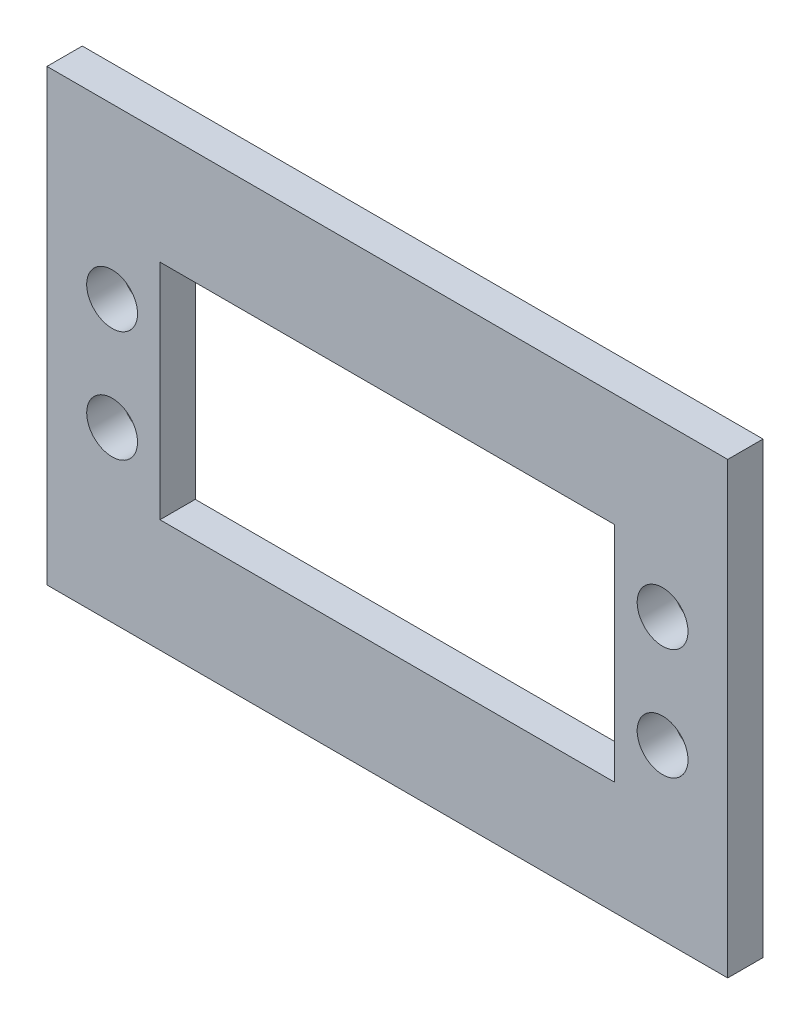
ISO-10303-21;
HEADER;
FILE_DESCRIPTION(('STEP AP214'),'2;1');
FILE_NAME('part.step','',(''),(''),'','','');
FILE_SCHEMA(('AUTOMOTIVE_DESIGN { 1 0 10303 214 1 1 1 1 }'));
ENDSEC;
DATA;
#1=APPLICATION_CONTEXT('core data for automotive mechanical design processes');
#2=APPLICATION_PROTOCOL_DEFINITION('international standard','automotive_design',2000,#1);
#3=PRODUCT_CONTEXT('',#1,'mechanical');
#4=PRODUCT('Part','Part','',(#3));
#5=PRODUCT_RELATED_PRODUCT_CATEGORY('part','',(#4));
#6=PRODUCT_DEFINITION_FORMATION('','',#4);
#7=PRODUCT_DEFINITION_CONTEXT('part definition',#1,'design');
#8=PRODUCT_DEFINITION('design','',#6,#7);
#9=PRODUCT_DEFINITION_SHAPE('','',#8);
#10=(LENGTH_UNIT() NAMED_UNIT(*) SI_UNIT(.MILLI.,.METRE.));
#11=(NAMED_UNIT(*) PLANE_ANGLE_UNIT() SI_UNIT($,.RADIAN.));
#12=(NAMED_UNIT(*) SI_UNIT($,.STERADIAN.) SOLID_ANGLE_UNIT());
#13=UNCERTAINTY_MEASURE_WITH_UNIT(LENGTH_MEASURE(1.E-05),#10,'distance_accuracy_value','');
#14=(GEOMETRIC_REPRESENTATION_CONTEXT(3) GLOBAL_UNCERTAINTY_ASSIGNED_CONTEXT((#13)) GLOBAL_UNIT_ASSIGNED_CONTEXT((#10,
#11,#12)) REPRESENTATION_CONTEXT('',''));
#15=CARTESIAN_POINT('',(0.,0.,0.));
#16=DIRECTION('',(0.,0.,1.));
#17=DIRECTION('',(1.,0.,0.));
#18=AXIS2_PLACEMENT_3D('',#15,#16,#17);
#19=CARTESIAN_POINT('',(0.,0.,3.175));
#20=DIRECTION('',(0.,0.,1.));
#21=DIRECTION('',(1.,0.,0.));
#22=AXIS2_PLACEMENT_3D('',#19,#20,#21);
#23=PLANE('',#22);
#24=CARTESIAN_POINT('',(45.197,15.033,3.175));
#25=DIRECTION('',(0.,0.,1.));
#26=DIRECTION('',(-1.,0.,0.));
#27=AXIS2_PLACEMENT_3D('',#24,#25,#26);
#28=CIRCLE('',#27,2.28599999999999);
#29=CARTESIAN_POINT('',(42.911,15.033,3.175));
#30=VERTEX_POINT('',#29);
#31=EDGE_CURVE('E258',#30,#30,#28,.T.);
#32=ORIENTED_EDGE('',*,*,#31,.F.);
#33=EDGE_LOOP('',(#32));
#34=FACE_BOUND('',#33,.T.);
#35=CARTESIAN_POINT('',(45.197,5.03300000000001,3.175));
#36=DIRECTION('',(0.,0.,1.));
#37=DIRECTION('',(1.,0.,0.));
#38=AXIS2_PLACEMENT_3D('',#35,#36,#37);
#39=CIRCLE('',#38,2.286);
#40=CARTESIAN_POINT('',(47.483,5.03300000000001,3.175));
#41=VERTEX_POINT('',#40);
#42=EDGE_CURVE('E250',#41,#41,#39,.T.);
#43=ORIENTED_EDGE('',*,*,#42,.F.);
#44=EDGE_LOOP('',(#43));
#45=FACE_BOUND('',#44,.T.);
#46=CARTESIAN_POINT('',(-4.303,5.033,3.175));
#47=DIRECTION('',(0.,0.,1.));
#48=DIRECTION('',(-1.,0.,0.));
#49=AXIS2_PLACEMENT_3D('',#46,#47,#48);
#50=CIRCLE('',#49,2.286);
#51=CARTESIAN_POINT('',(-6.589,5.033,3.175));
#52=VERTEX_POINT('',#51);
#53=EDGE_CURVE('E243',#52,#52,#50,.T.);
#54=ORIENTED_EDGE('',*,*,#53,.F.);
#55=EDGE_LOOP('',(#54));
#56=FACE_BOUND('',#55,.T.);
#57=CARTESIAN_POINT('',(-4.303,15.033,3.175));
#58=DIRECTION('',(0.,0.,1.));
#59=DIRECTION('',(1.,0.,0.));
#60=AXIS2_PLACEMENT_3D('',#57,#58,#59);
#61=CIRCLE('',#60,2.286);
#62=CARTESIAN_POINT('',(-2.017,15.033,3.175));
#63=VERTEX_POINT('',#62);
#64=EDGE_CURVE('E247',#63,#63,#61,.T.);
#65=ORIENTED_EDGE('',*,*,#64,.F.);
#66=EDGE_LOOP('',(#65));
#67=FACE_BOUND('',#66,.T.);
#68=DIRECTION('',(1.,0.,0.));
#69=VECTOR('',#68,1.);
#70=CARTESIAN_POINT('',(-10.16,-10.16,3.175));
#71=LINE('',#70,#69);
#72=CARTESIAN_POINT('',(-10.16,-10.16,3.175));
#73=VERTEX_POINT('',#72);
#74=CARTESIAN_POINT('',(51.054,-10.16,3.175));
#75=VERTEX_POINT('',#74);
#76=EDGE_CURVE('E140',#73,#75,#71,.T.);
#77=ORIENTED_EDGE('',*,*,#76,.T.);
#78=DIRECTION('',(0.,1.,0.));
#79=VECTOR('',#78,1.);
#80=CARTESIAN_POINT('',(51.054,-10.16,3.175));
#81=LINE('',#80,#79);
#82=CARTESIAN_POINT('',(51.054,30.226,3.175));
#83=VERTEX_POINT('',#82);
#84=EDGE_CURVE('E143',#75,#83,#81,.T.);
#85=ORIENTED_EDGE('',*,*,#84,.T.);
#86=DIRECTION('',(-1.,0.,0.));
#87=VECTOR('',#86,1.);
#88=CARTESIAN_POINT('',(-10.16,30.226,3.175));
#89=LINE('',#88,#87);
#90=CARTESIAN_POINT('',(-10.16,30.226,3.175));
#91=VERTEX_POINT('',#90);
#92=EDGE_CURVE('E146',#83,#91,#89,.T.);
#93=ORIENTED_EDGE('',*,*,#92,.T.);
#94=DIRECTION('',(0.,-1.,0.));
#95=VECTOR('',#94,1.);
#96=CARTESIAN_POINT('',(-10.16,-10.16,3.175));
#97=LINE('',#96,#95);
#98=EDGE_CURVE('E148',#91,#73,#97,.T.);
#99=ORIENTED_EDGE('',*,*,#98,.T.);
#100=EDGE_LOOP('',(#77,#85,#93,#99));
#101=FACE_BOUND('',#100,.T.);
#102=DIRECTION('',(1.,0.,0.));
#103=VECTOR('',#102,1.);
#104=CARTESIAN_POINT('',(0.,0.,3.175));
#105=LINE('',#104,#103);
#106=CARTESIAN_POINT('',(0.,0.,3.175));
#107=VERTEX_POINT('',#106);
#108=CARTESIAN_POINT('',(40.894,0.,3.175));
#109=VERTEX_POINT('',#108);
#110=EDGE_CURVE('E110',#107,#109,#105,.T.);
#111=ORIENTED_EDGE('',*,*,#110,.F.);
#112=DIRECTION('',(0.,-1.,0.));
#113=VECTOR('',#112,1.);
#114=CARTESIAN_POINT('',(0.,0.,3.175));
#115=LINE('',#114,#113);
#116=CARTESIAN_POINT('',(0.,20.066,3.175));
#117=VERTEX_POINT('',#116);
#118=EDGE_CURVE('E102',#117,#107,#115,.T.);
#119=ORIENTED_EDGE('',*,*,#118,.F.);
#120=DIRECTION('',(-1.,0.,0.));
#121=VECTOR('',#120,1.);
#122=CARTESIAN_POINT('',(0.,20.066,3.175));
#123=LINE('',#122,#121);
#124=CARTESIAN_POINT('',(40.894,20.066,3.175));
#125=VERTEX_POINT('',#124);
#126=EDGE_CURVE('E124',#125,#117,#123,.T.);
#127=ORIENTED_EDGE('',*,*,#126,.F.);
#128=DIRECTION('',(0.,1.,0.));
#129=VECTOR('',#128,1.);
#130=CARTESIAN_POINT('',(40.894,0.,3.175));
#131=LINE('',#130,#129);
#132=EDGE_CURVE('E122',#109,#125,#131,.T.);
#133=ORIENTED_EDGE('',*,*,#132,.F.);
#134=EDGE_LOOP('',(#111,#119,#127,#133));
#135=FACE_BOUND('',#134,.T.);
#136=ADVANCED_FACE('F37',(#34,#45,#56,#67,#101,#135),#23,.T.);
#137=CARTESIAN_POINT('',(0.,0.,0.));
#138=DIRECTION('',(0.,0.,1.));
#139=DIRECTION('',(1.,0.,0.));
#140=AXIS2_PLACEMENT_3D('',#137,#138,#139);
#141=PLANE('',#140);
#142=CARTESIAN_POINT('',(45.197,15.033,0.));
#143=DIRECTION('',(0.,0.,1.));
#144=DIRECTION('',(-1.,0.,0.));
#145=AXIS2_PLACEMENT_3D('',#142,#143,#144);
#146=CIRCLE('',#145,2.28599999999999);
#147=CARTESIAN_POINT('',(42.911,15.033,0.));
#148=VERTEX_POINT('',#147);
#149=EDGE_CURVE('E255',#148,#148,#146,.T.);
#150=ORIENTED_EDGE('',*,*,#149,.T.);
#151=EDGE_LOOP('',(#150));
#152=FACE_BOUND('',#151,.T.);
#153=CARTESIAN_POINT('',(45.197,5.03300000000001,0.));
#154=DIRECTION('',(0.,0.,1.));
#155=DIRECTION('',(1.,0.,0.));
#156=AXIS2_PLACEMENT_3D('',#153,#154,#155);
#157=CIRCLE('',#156,2.286);
#158=CARTESIAN_POINT('',(47.483,5.03300000000001,0.));
#159=VERTEX_POINT('',#158);
#160=EDGE_CURVE('E245',#159,#159,#157,.T.);
#161=ORIENTED_EDGE('',*,*,#160,.T.);
#162=EDGE_LOOP('',(#161));
#163=FACE_BOUND('',#162,.T.);
#164=CARTESIAN_POINT('',(-4.303,5.033,0.));
#165=DIRECTION('',(0.,0.,1.));
#166=DIRECTION('',(-1.,0.,0.));
#167=AXIS2_PLACEMENT_3D('',#164,#165,#166);
#168=CIRCLE('',#167,2.286);
#169=CARTESIAN_POINT('',(-6.589,5.033,0.));
#170=VERTEX_POINT('',#169);
#171=EDGE_CURVE('E240',#170,#170,#168,.T.);
#172=ORIENTED_EDGE('',*,*,#171,.T.);
#173=EDGE_LOOP('',(#172));
#174=FACE_BOUND('',#173,.T.);
#175=CARTESIAN_POINT('',(-4.303,15.033,0.));
#176=DIRECTION('',(0.,0.,1.));
#177=DIRECTION('',(1.,0.,0.));
#178=AXIS2_PLACEMENT_3D('',#175,#176,#177);
#179=CIRCLE('',#178,2.286);
#180=CARTESIAN_POINT('',(-2.017,15.033,0.));
#181=VERTEX_POINT('',#180);
#182=EDGE_CURVE('E130',#181,#181,#179,.T.);
#183=ORIENTED_EDGE('',*,*,#182,.T.);
#184=EDGE_LOOP('',(#183));
#185=FACE_BOUND('',#184,.T.);
#186=DIRECTION('',(1.,0.,0.));
#187=VECTOR('',#186,1.);
#188=CARTESIAN_POINT('',(-10.16,-10.16,0.));
#189=LINE('',#188,#187);
#190=CARTESIAN_POINT('',(-10.16,-10.16,0.));
#191=VERTEX_POINT('',#190);
#192=CARTESIAN_POINT('',(51.054,-10.16,0.));
#193=VERTEX_POINT('',#192);
#194=EDGE_CURVE('E118',#191,#193,#189,.T.);
#195=ORIENTED_EDGE('',*,*,#194,.F.);
#196=DIRECTION('',(0.,-1.,0.));
#197=VECTOR('',#196,1.);
#198=CARTESIAN_POINT('',(-10.16,-10.16,0.));
#199=LINE('',#198,#197);
#200=CARTESIAN_POINT('',(-10.16,30.226,0.));
#201=VERTEX_POINT('',#200);
#202=EDGE_CURVE('E144',#201,#191,#199,.T.);
#203=ORIENTED_EDGE('',*,*,#202,.F.);
#204=DIRECTION('',(-1.,0.,0.));
#205=VECTOR('',#204,1.);
#206=CARTESIAN_POINT('',(-10.16,30.226,0.));
#207=LINE('',#206,#205);
#208=CARTESIAN_POINT('',(51.054,30.226,0.));
#209=VERTEX_POINT('',#208);
#210=EDGE_CURVE('E155',#209,#201,#207,.T.);
#211=ORIENTED_EDGE('',*,*,#210,.F.);
#212=DIRECTION('',(0.,1.,0.));
#213=VECTOR('',#212,1.);
#214=CARTESIAN_POINT('',(51.054,-10.16,0.));
#215=LINE('',#214,#213);
#216=EDGE_CURVE('E153',#193,#209,#215,.T.);
#217=ORIENTED_EDGE('',*,*,#216,.F.);
#218=EDGE_LOOP('',(#195,#203,#211,#217));
#219=FACE_BOUND('',#218,.T.);
#220=DIRECTION('',(0.,-1.,0.));
#221=VECTOR('',#220,1.);
#222=CARTESIAN_POINT('',(0.,0.,0.));
#223=LINE('',#222,#221);
#224=CARTESIAN_POINT('',(0.,20.066,0.));
#225=VERTEX_POINT('',#224);
#226=CARTESIAN_POINT('',(0.,0.,0.));
#227=VERTEX_POINT('',#226);
#228=EDGE_CURVE('E60',#225,#227,#223,.T.);
#229=ORIENTED_EDGE('',*,*,#228,.T.);
#230=DIRECTION('',(1.,0.,0.));
#231=VECTOR('',#230,1.);
#232=CARTESIAN_POINT('',(0.,0.,0.));
#233=LINE('',#232,#231);
#234=CARTESIAN_POINT('',(40.894,0.,0.));
#235=VERTEX_POINT('',#234);
#236=EDGE_CURVE('E117',#227,#235,#233,.T.);
#237=ORIENTED_EDGE('',*,*,#236,.T.);
#238=DIRECTION('',(0.,1.,0.));
#239=VECTOR('',#238,1.);
#240=CARTESIAN_POINT('',(40.894,0.,0.));
#241=LINE('',#240,#239);
#242=CARTESIAN_POINT('',(40.894,20.066,0.));
#243=VERTEX_POINT('',#242);
#244=EDGE_CURVE('E132',#235,#243,#241,.T.);
#245=ORIENTED_EDGE('',*,*,#244,.T.);
#246=DIRECTION('',(-1.,0.,0.));
#247=VECTOR('',#246,1.);
#248=CARTESIAN_POINT('',(0.,20.066,0.));
#249=LINE('',#248,#247);
#250=EDGE_CURVE('E111',#243,#225,#249,.T.);
#251=ORIENTED_EDGE('',*,*,#250,.T.);
#252=EDGE_LOOP('',(#229,#237,#245,#251));
#253=FACE_BOUND('',#252,.T.);
#254=ADVANCED_FACE('F173',(#152,#163,#174,#185,#219,#253),#141,.F.);
#255=CARTESIAN_POINT('',(-10.16,-10.16,3.175));
#256=DIRECTION('',(0.,1.,0.));
#257=DIRECTION('',(0.,0.,1.));
#258=AXIS2_PLACEMENT_3D('',#255,#256,#257);
#259=PLANE('',#258);
#260=ORIENTED_EDGE('',*,*,#194,.T.);
#261=DIRECTION('',(0.,0.,-1.));
#262=VECTOR('',#261,1.);
#263=CARTESIAN_POINT('',(51.054,-10.16,3.175));
#264=LINE('',#263,#262);
#265=EDGE_CURVE('E11',#75,#193,#264,.T.);
#266=ORIENTED_EDGE('',*,*,#265,.F.);
#267=ORIENTED_EDGE('',*,*,#76,.F.);
#268=DIRECTION('',(0.,0.,-1.));
#269=VECTOR('',#268,1.);
#270=CARTESIAN_POINT('',(-10.16,-10.16,3.175));
#271=LINE('',#270,#269);
#272=EDGE_CURVE('E150',#73,#191,#271,.T.);
#273=ORIENTED_EDGE('',*,*,#272,.T.);
#274=EDGE_LOOP('',(#260,#266,#267,#273));
#275=FACE_BOUND('',#274,.T.);
#276=ADVANCED_FACE('F39',(#275),#259,.F.);
#277=CARTESIAN_POINT('',(51.054,-10.16,3.175));
#278=DIRECTION('',(-1.,0.,0.));
#279=DIRECTION('',(0.,0.,1.));
#280=AXIS2_PLACEMENT_3D('',#277,#278,#279);
#281=PLANE('',#280);
#282=ORIENTED_EDGE('',*,*,#216,.T.);
#283=DIRECTION('',(0.,0.,-1.));
#284=VECTOR('',#283,1.);
#285=CARTESIAN_POINT('',(51.054,30.226,3.175));
#286=LINE('',#285,#284);
#287=EDGE_CURVE('E45',#83,#209,#286,.T.);
#288=ORIENTED_EDGE('',*,*,#287,.F.);
#289=ORIENTED_EDGE('',*,*,#84,.F.);
#290=ORIENTED_EDGE('',*,*,#265,.T.);
#291=EDGE_LOOP('',(#282,#288,#289,#290));
#292=FACE_BOUND('',#291,.T.);
#293=ADVANCED_FACE('F183',(#292),#281,.F.);
#294=CARTESIAN_POINT('',(-10.16,30.226,3.175));
#295=DIRECTION('',(0.,-1.,0.));
#296=DIRECTION('',(0.,0.,-1.));
#297=AXIS2_PLACEMENT_3D('',#294,#295,#296);
#298=PLANE('',#297);
#299=ORIENTED_EDGE('',*,*,#210,.T.);
#300=DIRECTION('',(0.,0.,-1.));
#301=VECTOR('',#300,1.);
#302=CARTESIAN_POINT('',(-10.16,30.226,3.175));
#303=LINE('',#302,#301);
#304=EDGE_CURVE('E160',#91,#201,#303,.T.);
#305=ORIENTED_EDGE('',*,*,#304,.F.);
#306=ORIENTED_EDGE('',*,*,#92,.F.);
#307=ORIENTED_EDGE('',*,*,#287,.T.);
#308=EDGE_LOOP('',(#299,#305,#306,#307));
#309=FACE_BOUND('',#308,.T.);
#310=ADVANCED_FACE('F167',(#309),#298,.F.);
#311=CARTESIAN_POINT('',(-10.16,-10.16,3.175));
#312=DIRECTION('',(1.,0.,0.));
#313=DIRECTION('',(0.,0.,-1.));
#314=AXIS2_PLACEMENT_3D('',#311,#312,#313);
#315=PLANE('',#314);
#316=ORIENTED_EDGE('',*,*,#202,.T.);
#317=ORIENTED_EDGE('',*,*,#272,.F.);
#318=ORIENTED_EDGE('',*,*,#98,.F.);
#319=ORIENTED_EDGE('',*,*,#304,.T.);
#320=EDGE_LOOP('',(#316,#317,#318,#319));
#321=FACE_BOUND('',#320,.T.);
#322=ADVANCED_FACE('F177',(#321),#315,.F.);
#323=CARTESIAN_POINT('',(0.,0.,3.175));
#324=DIRECTION('',(1.,0.,0.));
#325=DIRECTION('',(0.,0.,-1.));
#326=AXIS2_PLACEMENT_3D('',#323,#324,#325);
#327=PLANE('',#326);
#328=ORIENTED_EDGE('',*,*,#228,.F.);
#329=DIRECTION('',(0.,0.,-1.));
#330=VECTOR('',#329,1.);
#331=CARTESIAN_POINT('',(0.,20.066,3.175));
#332=LINE('',#331,#330);
#333=EDGE_CURVE('E106',#117,#225,#332,.T.);
#334=ORIENTED_EDGE('',*,*,#333,.F.);
#335=ORIENTED_EDGE('',*,*,#118,.T.);
#336=DIRECTION('',(0.,0.,-1.));
#337=VECTOR('',#336,1.);
#338=CARTESIAN_POINT('',(0.,0.,3.175));
#339=LINE('',#338,#337);
#340=EDGE_CURVE('E105',#107,#227,#339,.T.);
#341=ORIENTED_EDGE('',*,*,#340,.T.);
#342=EDGE_LOOP('',(#328,#334,#335,#341));
#343=FACE_BOUND('',#342,.T.);
#344=ADVANCED_FACE('F104',(#343),#327,.T.);
#345=CARTESIAN_POINT('',(0.,0.,3.175));
#346=DIRECTION('',(0.,1.,0.));
#347=DIRECTION('',(0.,0.,1.));
#348=AXIS2_PLACEMENT_3D('',#345,#346,#347);
#349=PLANE('',#348);
#350=ORIENTED_EDGE('',*,*,#236,.F.);
#351=ORIENTED_EDGE('',*,*,#340,.F.);
#352=ORIENTED_EDGE('',*,*,#110,.T.);
#353=DIRECTION('',(0.,0.,-1.));
#354=VECTOR('',#353,1.);
#355=CARTESIAN_POINT('',(40.894,0.,3.175));
#356=LINE('',#355,#354);
#357=EDGE_CURVE('E119',#109,#235,#356,.T.);
#358=ORIENTED_EDGE('',*,*,#357,.T.);
#359=EDGE_LOOP('',(#350,#351,#352,#358));
#360=FACE_BOUND('',#359,.T.);
#361=ADVANCED_FACE('F114',(#360),#349,.T.);
#362=CARTESIAN_POINT('',(40.894,0.,3.175));
#363=DIRECTION('',(-1.,0.,0.));
#364=DIRECTION('',(0.,0.,1.));
#365=AXIS2_PLACEMENT_3D('',#362,#363,#364);
#366=PLANE('',#365);
#367=ORIENTED_EDGE('',*,*,#244,.F.);
#368=ORIENTED_EDGE('',*,*,#357,.F.);
#369=ORIENTED_EDGE('',*,*,#132,.T.);
#370=DIRECTION('',(0.,0.,-1.));
#371=VECTOR('',#370,1.);
#372=CARTESIAN_POINT('',(40.894,20.066,3.175));
#373=LINE('',#372,#371);
#374=EDGE_CURVE('E52',#125,#243,#373,.T.);
#375=ORIENTED_EDGE('',*,*,#374,.T.);
#376=EDGE_LOOP('',(#367,#368,#369,#375));
#377=FACE_BOUND('',#376,.T.);
#378=ADVANCED_FACE('F210',(#377),#366,.T.);
#379=CARTESIAN_POINT('',(0.,20.066,3.175));
#380=DIRECTION('',(0.,-1.,0.));
#381=DIRECTION('',(0.,0.,-1.));
#382=AXIS2_PLACEMENT_3D('',#379,#380,#381);
#383=PLANE('',#382);
#384=ORIENTED_EDGE('',*,*,#250,.F.);
#385=ORIENTED_EDGE('',*,*,#374,.F.);
#386=ORIENTED_EDGE('',*,*,#126,.T.);
#387=ORIENTED_EDGE('',*,*,#333,.T.);
#388=EDGE_LOOP('',(#384,#385,#386,#387));
#389=FACE_BOUND('',#388,.T.);
#390=ADVANCED_FACE('F214',(#389),#383,.T.);
#391=CARTESIAN_POINT('',(-4.303,15.033,0.));
#392=DIRECTION('',(0.,0.,1.));
#393=DIRECTION('',(1.,0.,0.));
#394=AXIS2_PLACEMENT_3D('',#391,#392,#393);
#395=CYLINDRICAL_SURFACE('',#394,2.286);
#396=ORIENTED_EDGE('',*,*,#182,.F.);
#397=EDGE_LOOP('',(#396));
#398=FACE_BOUND('',#397,.T.);
#399=ORIENTED_EDGE('',*,*,#64,.T.);
#400=EDGE_LOOP('',(#399));
#401=FACE_BOUND('',#400,.T.);
#402=ADVANCED_FACE('F220',(#398,#401),#395,.F.);
#403=CARTESIAN_POINT('',(-4.303,5.033,0.));
#404=DIRECTION('',(0.,0.,1.));
#405=DIRECTION('',(1.,0.,0.));
#406=AXIS2_PLACEMENT_3D('',#403,#404,#405);
#407=CYLINDRICAL_SURFACE('',#406,2.286);
#408=ORIENTED_EDGE('',*,*,#171,.F.);
#409=EDGE_LOOP('',(#408));
#410=FACE_BOUND('',#409,.T.);
#411=ORIENTED_EDGE('',*,*,#53,.T.);
#412=EDGE_LOOP('',(#411));
#413=FACE_BOUND('',#412,.T.);
#414=ADVANCED_FACE('F223',(#410,#413),#407,.F.);
#415=CARTESIAN_POINT('',(45.197,5.03300000000001,0.));
#416=DIRECTION('',(0.,0.,1.));
#417=DIRECTION('',(1.,0.,0.));
#418=AXIS2_PLACEMENT_3D('',#415,#416,#417);
#419=CYLINDRICAL_SURFACE('',#418,2.286);
#420=ORIENTED_EDGE('',*,*,#160,.F.);
#421=EDGE_LOOP('',(#420));
#422=FACE_BOUND('',#421,.T.);
#423=ORIENTED_EDGE('',*,*,#42,.T.);
#424=EDGE_LOOP('',(#423));
#425=FACE_BOUND('',#424,.T.);
#426=ADVANCED_FACE('F228',(#422,#425),#419,.F.);
#427=CARTESIAN_POINT('',(45.197,15.033,0.));
#428=DIRECTION('',(0.,0.,1.));
#429=DIRECTION('',(1.,0.,0.));
#430=AXIS2_PLACEMENT_3D('',#427,#428,#429);
#431=CYLINDRICAL_SURFACE('',#430,2.28599999999999);
#432=ORIENTED_EDGE('',*,*,#149,.F.);
#433=EDGE_LOOP('',(#432));
#434=FACE_BOUND('',#433,.T.);
#435=ORIENTED_EDGE('',*,*,#31,.T.);
#436=EDGE_LOOP('',(#435));
#437=FACE_BOUND('',#436,.T.);
#438=ADVANCED_FACE('F225',(#434,#437),#431,.F.);
#439=CLOSED_SHELL('',(#136,#254,#276,#293,#310,#322,#344,#361,#378,#390,#402,#414,#426,#438));
#440=MANIFOLD_SOLID_BREP('B2',#439);
#441=ADVANCED_BREP_SHAPE_REPRESENTATION('',(#18,#440),#14);
#442=SHAPE_DEFINITION_REPRESENTATION(#9,#441);
ENDSEC;
END-ISO-10303-21;
